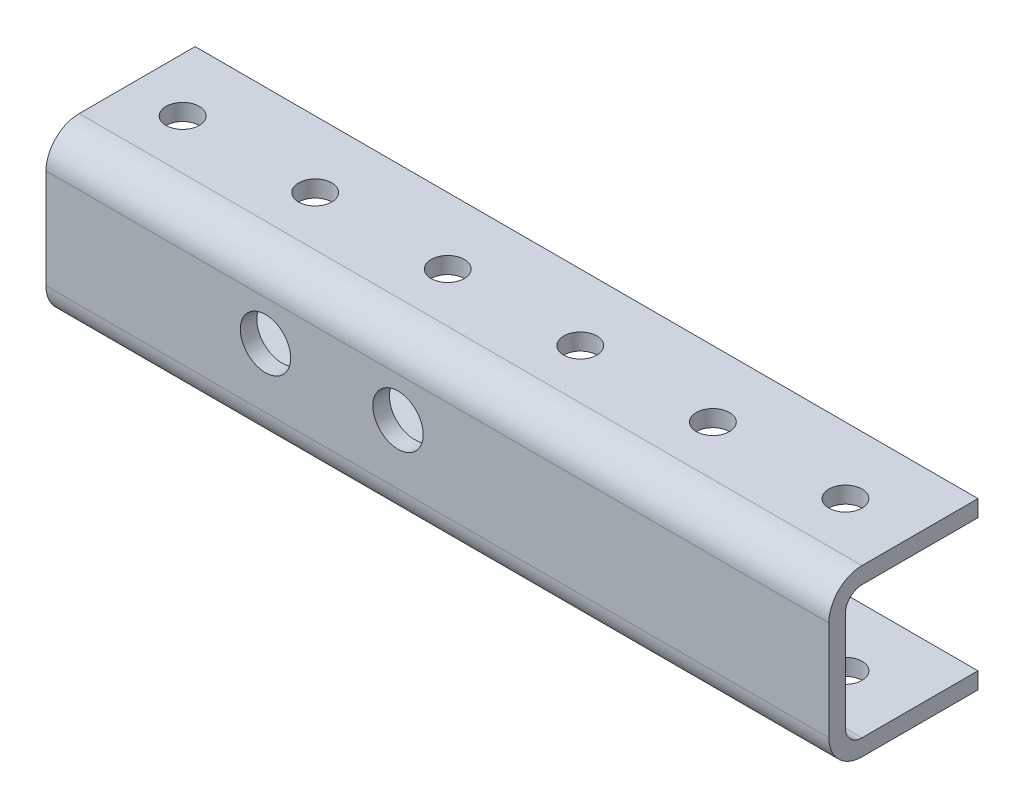
ISO-10303-21;
HEADER;
FILE_DESCRIPTION(('STEP AP214'),'2;1');
FILE_NAME('part.step','',(''),(''),'','','');
FILE_SCHEMA(('AUTOMOTIVE_DESIGN { 1 0 10303 214 1 1 1 1 }'));
ENDSEC;
DATA;
#1=APPLICATION_CONTEXT('core data for automotive mechanical design processes');
#2=APPLICATION_PROTOCOL_DEFINITION('international standard','automotive_design',2000,#1);
#3=PRODUCT_CONTEXT('',#1,'mechanical');
#4=PRODUCT('Part','Part','',(#3));
#5=PRODUCT_RELATED_PRODUCT_CATEGORY('part','',(#4));
#6=PRODUCT_DEFINITION_FORMATION('','',#4);
#7=PRODUCT_DEFINITION_CONTEXT('part definition',#1,'design');
#8=PRODUCT_DEFINITION('design','',#6,#7);
#9=PRODUCT_DEFINITION_SHAPE('','',#8);
#10=(LENGTH_UNIT() NAMED_UNIT(*) SI_UNIT(.MILLI.,.METRE.));
#11=(NAMED_UNIT(*) PLANE_ANGLE_UNIT() SI_UNIT($,.RADIAN.));
#12=(NAMED_UNIT(*) SI_UNIT($,.STERADIAN.) SOLID_ANGLE_UNIT());
#13=UNCERTAINTY_MEASURE_WITH_UNIT(LENGTH_MEASURE(1.E-05),#10,'distance_accuracy_value','');
#14=(GEOMETRIC_REPRESENTATION_CONTEXT(3) GLOBAL_UNCERTAINTY_ASSIGNED_CONTEXT((#13)) GLOBAL_UNIT_ASSIGNED_CONTEXT((#10,
#11,#12)) REPRESENTATION_CONTEXT('',''));
#15=CARTESIAN_POINT('',(0.,0.,0.));
#16=DIRECTION('',(0.,0.,1.));
#17=DIRECTION('',(1.,0.,0.));
#18=AXIS2_PLACEMENT_3D('',#15,#16,#17);
#19=CARTESIAN_POINT('',(872.981011996506,-4.02704283352276,-25.4));
#20=DIRECTION('',(0.,-1.,0.));
#21=DIRECTION('',(0.,0.,-1.));
#22=AXIS2_PLACEMENT_3D('',#19,#20,#21);
#23=PLANE('',#22);
#24=DIRECTION('',(-1.,0.,0.));
#25=VECTOR('',#24,1.);
#26=CARTESIAN_POINT('',(872.981011996506,-4.02704283352276,-25.4));
#27=LINE('',#26,#25);
#28=CARTESIAN_POINT('',(872.980011996506,-4.02704283352276,-25.4));
#29=VERTEX_POINT('',#28);
#30=CARTESIAN_POINT('',(722.980011996506,-4.02704283352276,-25.4));
#31=VERTEX_POINT('',#30);
#32=EDGE_CURVE('E155',#29,#31,#27,.T.);
#33=ORIENTED_EDGE('',*,*,#32,.T.);
#34=DIRECTION('',(0.,0.,1.));
#35=VECTOR('',#34,1.);
#36=CARTESIAN_POINT('',(722.980011996506,-4.02704283352276,-25.4));
#37=LINE('',#36,#35);
#38=CARTESIAN_POINT('',(722.980011996506,-4.02704283352272,-3.175));
#39=VERTEX_POINT('',#38);
#40=EDGE_CURVE('E387',#31,#39,#37,.T.);
#41=ORIENTED_EDGE('',*,*,#40,.T.);
#42=DIRECTION('',(-1.,0.,0.));
#43=VECTOR('',#42,1.);
#44=CARTESIAN_POINT('',(872.980011996506,-4.02704283352272,-3.17499999999999));
#45=LINE('',#44,#43);
#46=CARTESIAN_POINT('',(872.980011996506,-4.02704283352272,-3.17499999999999));
#47=VERTEX_POINT('',#46);
#48=EDGE_CURVE('E251',#39,#47,#45,.F.);
#49=ORIENTED_EDGE('',*,*,#48,.T.);
#50=DIRECTION('',(0.,0.,1.));
#51=VECTOR('',#50,1.);
#52=CARTESIAN_POINT('',(872.980011996506,-4.02704283352276,-25.4));
#53=LINE('',#52,#51);
#54=EDGE_CURVE('E385',#29,#47,#53,.T.);
#55=ORIENTED_EDGE('',*,*,#54,.F.);
#56=EDGE_LOOP('',(#33,#41,#49,#55));
#57=FACE_BOUND('',#56,.T.);
#58=CARTESIAN_POINT('',(733.280011996506,-4.02704283352274,-12.7000000000001));
#59=DIRECTION('',(0.,1.,0.));
#60=DIRECTION('',(0.,0.,1.));
#61=AXIS2_PLACEMENT_3D('',#58,#59,#60);
#62=CIRCLE('',#61,3.17500000000001);
#63=CARTESIAN_POINT('',(733.280011996506,-4.02704283352273,-9.52500000000009));
#64=VERTEX_POINT('',#63);
#65=EDGE_CURVE('E205',#64,#64,#62,.T.);
#66=ORIENTED_EDGE('',*,*,#65,.F.);
#67=EDGE_LOOP('',(#66));
#68=FACE_BOUND('',#67,.T.);
#69=CARTESIAN_POINT('',(758.680011996506,-4.02704283352274,-12.7000000000001));
#70=DIRECTION('',(0.,1.,0.));
#71=DIRECTION('',(0.,0.,1.));
#72=AXIS2_PLACEMENT_3D('',#69,#70,#71);
#73=CIRCLE('',#72,3.17500000000001);
#74=CARTESIAN_POINT('',(758.680011996506,-4.02704283352273,-9.5250000000001));
#75=VERTEX_POINT('',#74);
#76=EDGE_CURVE('E211',#75,#75,#73,.T.);
#77=ORIENTED_EDGE('',*,*,#76,.F.);
#78=EDGE_LOOP('',(#77));
#79=FACE_BOUND('',#78,.T.);
#80=CARTESIAN_POINT('',(784.080011996506,-4.02704283352274,-12.7000000000001));
#81=DIRECTION('',(0.,1.,0.));
#82=DIRECTION('',(0.,0.,1.));
#83=AXIS2_PLACEMENT_3D('',#80,#81,#82);
#84=CIRCLE('',#83,3.17500000000001);
#85=CARTESIAN_POINT('',(784.080011996506,-4.02704283352273,-9.5250000000001));
#86=VERTEX_POINT('',#85);
#87=EDGE_CURVE('E217',#86,#86,#84,.T.);
#88=ORIENTED_EDGE('',*,*,#87,.F.);
#89=EDGE_LOOP('',(#88));
#90=FACE_BOUND('',#89,.T.);
#91=CARTESIAN_POINT('',(809.480011996506,-4.02704283352274,-12.7000000000001));
#92=DIRECTION('',(0.,1.,0.));
#93=DIRECTION('',(0.,0.,1.));
#94=AXIS2_PLACEMENT_3D('',#91,#92,#93);
#95=CIRCLE('',#94,3.17500000000001);
#96=CARTESIAN_POINT('',(809.480011996506,-4.02704283352273,-9.5250000000001));
#97=VERTEX_POINT('',#96);
#98=EDGE_CURVE('E223',#97,#97,#95,.T.);
#99=ORIENTED_EDGE('',*,*,#98,.F.);
#100=EDGE_LOOP('',(#99));
#101=FACE_BOUND('',#100,.T.);
#102=CARTESIAN_POINT('',(834.880011996506,-4.02704283352274,-12.7000000000001));
#103=DIRECTION('',(0.,1.,0.));
#104=DIRECTION('',(0.,0.,1.));
#105=AXIS2_PLACEMENT_3D('',#102,#103,#104);
#106=CIRCLE('',#105,3.17500000000001);
#107=CARTESIAN_POINT('',(834.880011996506,-4.02704283352273,-9.52500000000011));
#108=VERTEX_POINT('',#107);
#109=EDGE_CURVE('E229',#108,#108,#106,.T.);
#110=ORIENTED_EDGE('',*,*,#109,.F.);
#111=EDGE_LOOP('',(#110));
#112=FACE_BOUND('',#111,.T.);
#113=CARTESIAN_POINT('',(860.280011996506,-4.02704283352274,-12.7000000000001));
#114=DIRECTION('',(0.,1.,0.));
#115=DIRECTION('',(0.,0.,1.));
#116=AXIS2_PLACEMENT_3D('',#113,#114,#115);
#117=CIRCLE('',#116,3.17500000000001);
#118=CARTESIAN_POINT('',(860.280011996506,-4.02704283352273,-9.52500000000011));
#119=VERTEX_POINT('',#118);
#120=EDGE_CURVE('E235',#119,#119,#117,.T.);
#121=ORIENTED_EDGE('',*,*,#120,.F.);
#122=EDGE_LOOP('',(#121));
#123=FACE_BOUND('',#122,.T.);
#124=ADVANCED_FACE('F33',(#57,#68,#79,#90,#101,#112,#123),#23,.F.);
#125=CARTESIAN_POINT('',(872.980011996506,-7.20204283352271,-25.4));
#126=DIRECTION('',(0.,0.,1.));
#127=DIRECTION('',(1.,0.,0.));
#128=AXIS2_PLACEMENT_3D('',#125,#126,#127);
#129=PLANE('',#128);
#130=DIRECTION('',(-1.,0.,0.));
#131=VECTOR('',#130,1.);
#132=CARTESIAN_POINT('',(872.981011996506,21.3729571664772,-25.4));
#133=LINE('',#132,#131);
#134=CARTESIAN_POINT('',(872.980011996506,21.3729571664772,-25.4));
#135=VERTEX_POINT('',#134);
#136=CARTESIAN_POINT('',(722.980011996506,21.3729571664772,-25.4));
#137=VERTEX_POINT('',#136);
#138=EDGE_CURVE('E135',#135,#137,#133,.T.);
#139=ORIENTED_EDGE('',*,*,#138,.T.);
#140=DIRECTION('',(0.,-1.,0.));
#141=VECTOR('',#140,1.);
#142=CARTESIAN_POINT('',(722.980011996506,101.547957166477,-25.4));
#143=LINE('',#142,#141);
#144=CARTESIAN_POINT('',(722.980011996506,24.5479571664772,-25.4));
#145=VERTEX_POINT('',#144);
#146=EDGE_CURVE('E123',#145,#137,#143,.T.);
#147=ORIENTED_EDGE('',*,*,#146,.F.);
#148=DIRECTION('',(-1.,0.,0.));
#149=VECTOR('',#148,1.);
#150=CARTESIAN_POINT('',(872.980011996506,24.5479571664772,-25.4));
#151=LINE('',#150,#149);
#152=CARTESIAN_POINT('',(872.980011996506,24.5479571664772,-25.4));
#153=VERTEX_POINT('',#152);
#154=EDGE_CURVE('E133',#153,#145,#151,.T.);
#155=ORIENTED_EDGE('',*,*,#154,.F.);
#156=DIRECTION('',(0.,1.,0.));
#157=VECTOR('',#156,1.);
#158=CARTESIAN_POINT('',(872.980011996506,-7.20204283352271,-25.4));
#159=LINE('',#158,#157);
#160=EDGE_CURVE('E147',#135,#153,#159,.T.);
#161=ORIENTED_EDGE('',*,*,#160,.F.);
#162=EDGE_LOOP('',(#139,#147,#155,#161));
#163=FACE_BOUND('',#162,.T.);
#164=ADVANCED_FACE('F131',(#163),#129,.F.);
#165=CARTESIAN_POINT('',(-16.0199880034941,-7.20204283352271,-25.4));
#166=DIRECTION('',(0.,-1.,0.));
#167=DIRECTION('',(0.,0.,-1.));
#168=AXIS2_PLACEMENT_3D('',#165,#166,#167);
#169=PLANE('',#168);
#170=DIRECTION('',(0.,0.,1.));
#171=VECTOR('',#170,1.);
#172=CARTESIAN_POINT('',(722.980011996506,-7.20204283352271,-25.4));
#173=LINE('',#172,#171);
#174=CARTESIAN_POINT('',(722.980011996506,-7.20204283352271,-25.4));
#175=VERTEX_POINT('',#174);
#176=CARTESIAN_POINT('',(722.980011996506,-7.20204283352271,-3.175));
#177=VERTEX_POINT('',#176);
#178=EDGE_CURVE('E417',#175,#177,#173,.T.);
#179=ORIENTED_EDGE('',*,*,#178,.F.);
#180=DIRECTION('',(1.,0.,0.));
#181=VECTOR('',#180,1.);
#182=CARTESIAN_POINT('',(-16.0199880034941,-7.20204283352271,-25.4));
#183=LINE('',#182,#181);
#184=CARTESIAN_POINT('',(872.980011996506,-7.20204283352271,-25.4));
#185=VERTEX_POINT('',#184);
#186=EDGE_CURVE('E154',#175,#185,#183,.T.);
#187=ORIENTED_EDGE('',*,*,#186,.T.);
#188=DIRECTION('',(0.,0.,1.));
#189=VECTOR('',#188,1.);
#190=CARTESIAN_POINT('',(872.980011996506,-7.20204283352271,-25.4));
#191=LINE('',#190,#189);
#192=CARTESIAN_POINT('',(872.980011996506,-7.20204283352271,-3.175));
#193=VERTEX_POINT('',#192);
#194=EDGE_CURVE('E141',#185,#193,#191,.T.);
#195=ORIENTED_EDGE('',*,*,#194,.T.);
#196=DIRECTION('',(1.,0.,0.));
#197=VECTOR('',#196,1.);
#198=CARTESIAN_POINT('',(-16.0199880034941,-7.20204283352271,-3.175));
#199=LINE('',#198,#197);
#200=EDGE_CURVE('E259',#193,#177,#199,.F.);
#201=ORIENTED_EDGE('',*,*,#200,.T.);
#202=EDGE_LOOP('',(#179,#187,#195,#201));
#203=FACE_BOUND('',#202,.T.);
#204=CARTESIAN_POINT('',(733.280011996506,-7.20204283352271,-12.7000000000001));
#205=DIRECTION('',(0.,-1.,0.));
#206=DIRECTION('',(0.,0.,-1.));
#207=AXIS2_PLACEMENT_3D('',#204,#205,#206);
#208=CIRCLE('',#207,3.17500000000001);
#209=CARTESIAN_POINT('',(733.280011996506,-7.20204283352271,-15.8750000000001));
#210=VERTEX_POINT('',#209);
#211=EDGE_CURVE('E208',#210,#210,#208,.T.);
#212=ORIENTED_EDGE('',*,*,#211,.F.);
#213=EDGE_LOOP('',(#212));
#214=FACE_BOUND('',#213,.T.);
#215=CARTESIAN_POINT('',(758.680011996506,-7.20204283352271,-12.7000000000001));
#216=DIRECTION('',(0.,-1.,0.));
#217=DIRECTION('',(0.,0.,-1.));
#218=AXIS2_PLACEMENT_3D('',#215,#216,#217);
#219=CIRCLE('',#218,3.17500000000001);
#220=CARTESIAN_POINT('',(758.680011996506,-7.20204283352271,-15.8750000000001));
#221=VERTEX_POINT('',#220);
#222=EDGE_CURVE('E214',#221,#221,#219,.T.);
#223=ORIENTED_EDGE('',*,*,#222,.F.);
#224=EDGE_LOOP('',(#223));
#225=FACE_BOUND('',#224,.T.);
#226=CARTESIAN_POINT('',(784.080011996506,-7.20204283352271,-12.7000000000001));
#227=DIRECTION('',(0.,-1.,0.));
#228=DIRECTION('',(0.,0.,-1.));
#229=AXIS2_PLACEMENT_3D('',#226,#227,#228);
#230=CIRCLE('',#229,3.17500000000001);
#231=CARTESIAN_POINT('',(784.080011996506,-7.20204283352271,-15.8750000000001));
#232=VERTEX_POINT('',#231);
#233=EDGE_CURVE('E220',#232,#232,#230,.T.);
#234=ORIENTED_EDGE('',*,*,#233,.F.);
#235=EDGE_LOOP('',(#234));
#236=FACE_BOUND('',#235,.T.);
#237=CARTESIAN_POINT('',(809.480011996506,-7.20204283352271,-12.7000000000001));
#238=DIRECTION('',(0.,-1.,0.));
#239=DIRECTION('',(0.,0.,-1.));
#240=AXIS2_PLACEMENT_3D('',#237,#238,#239);
#241=CIRCLE('',#240,3.17500000000001);
#242=CARTESIAN_POINT('',(809.480011996506,-7.20204283352271,-15.8750000000001));
#243=VERTEX_POINT('',#242);
#244=EDGE_CURVE('E226',#243,#243,#241,.T.);
#245=ORIENTED_EDGE('',*,*,#244,.F.);
#246=EDGE_LOOP('',(#245));
#247=FACE_BOUND('',#246,.T.);
#248=CARTESIAN_POINT('',(834.880011996506,-7.20204283352271,-12.7000000000001));
#249=DIRECTION('',(0.,-1.,0.));
#250=DIRECTION('',(0.,0.,-1.));
#251=AXIS2_PLACEMENT_3D('',#248,#249,#250);
#252=CIRCLE('',#251,3.17500000000001);
#253=CARTESIAN_POINT('',(834.880011996506,-7.20204283352271,-15.8750000000001));
#254=VERTEX_POINT('',#253);
#255=EDGE_CURVE('E232',#254,#254,#252,.T.);
#256=ORIENTED_EDGE('',*,*,#255,.F.);
#257=EDGE_LOOP('',(#256));
#258=FACE_BOUND('',#257,.T.);
#259=CARTESIAN_POINT('',(860.280011996506,-7.20204283352271,-12.7000000000001));
#260=DIRECTION('',(0.,-1.,0.));
#261=DIRECTION('',(0.,0.,-1.));
#262=AXIS2_PLACEMENT_3D('',#259,#260,#261);
#263=CIRCLE('',#262,3.17500000000001);
#264=CARTESIAN_POINT('',(860.280011996506,-7.20204283352271,-15.8750000000001));
#265=VERTEX_POINT('',#264);
#266=EDGE_CURVE('E238',#265,#265,#263,.T.);
#267=ORIENTED_EDGE('',*,*,#266,.F.);
#268=EDGE_LOOP('',(#267));
#269=FACE_BOUND('',#268,.T.);
#270=ADVANCED_FACE('F291',(#203,#214,#225,#236,#247,#258,#269),#169,.T.);
#271=CARTESIAN_POINT('',(872.980011996506,24.5479571664772,-25.4));
#272=DIRECTION('',(0.,1.,0.));
#273=DIRECTION('',(-1.,0.,0.));
#274=AXIS2_PLACEMENT_3D('',#271,#272,#273);
#275=PLANE('',#274);
#276=DIRECTION('',(0.,0.,-1.));
#277=VECTOR('',#276,1.);
#278=CARTESIAN_POINT('',(722.980011996506,24.5479571664772,-25.4));
#279=LINE('',#278,#277);
#280=CARTESIAN_POINT('',(722.980011996506,24.5479571664772,-3.175));
#281=VERTEX_POINT('',#280);
#282=EDGE_CURVE('E120',#281,#145,#279,.T.);
#283=ORIENTED_EDGE('',*,*,#282,.F.);
#284=DIRECTION('',(-1.,0.,0.));
#285=VECTOR('',#284,1.);
#286=CARTESIAN_POINT('',(872.980011996506,24.5479571664772,-3.175));
#287=LINE('',#286,#285);
#288=CARTESIAN_POINT('',(872.980011996506,24.5479571664772,-3.175));
#289=VERTEX_POINT('',#288);
#290=EDGE_CURVE('E55',#281,#289,#287,.F.);
#291=ORIENTED_EDGE('',*,*,#290,.T.);
#292=DIRECTION('',(0.,0.,1.));
#293=VECTOR('',#292,1.);
#294=CARTESIAN_POINT('',(872.980011996506,24.5479571664772,-25.4));
#295=LINE('',#294,#293);
#296=EDGE_CURVE('E140',#153,#289,#295,.T.);
#297=ORIENTED_EDGE('',*,*,#296,.F.);
#298=ORIENTED_EDGE('',*,*,#154,.T.);
#299=EDGE_LOOP('',(#283,#291,#297,#298));
#300=FACE_BOUND('',#299,.T.);
#301=CARTESIAN_POINT('',(733.280011996506,24.5479571664772,-12.7000000000001));
#302=DIRECTION('',(0.,1.,0.));
#303=DIRECTION('',(0.,0.,1.));
#304=AXIS2_PLACEMENT_3D('',#301,#302,#303);
#305=CIRCLE('',#304,3.17500000000001);
#306=CARTESIAN_POINT('',(733.280011996506,24.5479571664772,-9.52500000000004));
#307=VERTEX_POINT('',#306);
#308=EDGE_CURVE('E160',#307,#307,#305,.T.);
#309=ORIENTED_EDGE('',*,*,#308,.F.);
#310=EDGE_LOOP('',(#309));
#311=FACE_BOUND('',#310,.T.);
#312=CARTESIAN_POINT('',(758.680011996506,24.5479571664772,-12.7000000000001));
#313=DIRECTION('',(0.,1.,0.));
#314=DIRECTION('',(0.,0.,1.));
#315=AXIS2_PLACEMENT_3D('',#312,#313,#314);
#316=CIRCLE('',#315,3.17500000000001);
#317=CARTESIAN_POINT('',(758.680011996506,24.5479571664772,-9.52500000000004));
#318=VERTEX_POINT('',#317);
#319=EDGE_CURVE('E166',#318,#318,#316,.T.);
#320=ORIENTED_EDGE('',*,*,#319,.F.);
#321=EDGE_LOOP('',(#320));
#322=FACE_BOUND('',#321,.T.);
#323=CARTESIAN_POINT('',(784.080011996506,24.5479571664772,-12.7000000000001));
#324=DIRECTION('',(0.,1.,0.));
#325=DIRECTION('',(0.,0.,1.));
#326=AXIS2_PLACEMENT_3D('',#323,#324,#325);
#327=CIRCLE('',#326,3.17500000000001);
#328=CARTESIAN_POINT('',(784.080011996506,24.5479571664772,-9.52500000000004));
#329=VERTEX_POINT('',#328);
#330=EDGE_CURVE('E172',#329,#329,#327,.T.);
#331=ORIENTED_EDGE('',*,*,#330,.F.);
#332=EDGE_LOOP('',(#331));
#333=FACE_BOUND('',#332,.T.);
#334=CARTESIAN_POINT('',(809.480011996506,24.5479571664772,-12.7000000000001));
#335=DIRECTION('',(0.,1.,0.));
#336=DIRECTION('',(0.,0.,1.));
#337=AXIS2_PLACEMENT_3D('',#334,#335,#336);
#338=CIRCLE('',#337,3.17500000000001);
#339=CARTESIAN_POINT('',(809.480011996506,24.5479571664772,-9.52500000000004));
#340=VERTEX_POINT('',#339);
#341=EDGE_CURVE('E178',#340,#340,#338,.T.);
#342=ORIENTED_EDGE('',*,*,#341,.F.);
#343=EDGE_LOOP('',(#342));
#344=FACE_BOUND('',#343,.T.);
#345=CARTESIAN_POINT('',(834.880011996506,24.5479571664772,-12.7000000000001));
#346=DIRECTION('',(0.,1.,0.));
#347=DIRECTION('',(0.,0.,1.));
#348=AXIS2_PLACEMENT_3D('',#345,#346,#347);
#349=CIRCLE('',#348,3.17500000000001);
#350=CARTESIAN_POINT('',(834.880011996506,24.5479571664772,-9.52500000000005));
#351=VERTEX_POINT('',#350);
#352=EDGE_CURVE('E184',#351,#351,#349,.T.);
#353=ORIENTED_EDGE('',*,*,#352,.F.);
#354=EDGE_LOOP('',(#353));
#355=FACE_BOUND('',#354,.T.);
#356=CARTESIAN_POINT('',(860.280011996506,24.5479571664772,-12.7000000000001));
#357=DIRECTION('',(0.,1.,0.));
#358=DIRECTION('',(0.,0.,1.));
#359=AXIS2_PLACEMENT_3D('',#356,#357,#358);
#360=CIRCLE('',#359,3.17500000000001);
#361=CARTESIAN_POINT('',(860.280011996506,24.5479571664772,-9.52500000000005));
#362=VERTEX_POINT('',#361);
#363=EDGE_CURVE('E190',#362,#362,#360,.T.);
#364=ORIENTED_EDGE('',*,*,#363,.F.);
#365=EDGE_LOOP('',(#364));
#366=FACE_BOUND('',#365,.T.);
#367=ADVANCED_FACE('F138',(#300,#311,#322,#333,#344,#355,#366),#275,.T.);
#368=CARTESIAN_POINT('',(872.980011996506,-7.20204283352271,-25.4));
#369=DIRECTION('',(1.,0.,0.));
#370=DIRECTION('',(0.,0.,-1.));
#371=AXIS2_PLACEMENT_3D('',#368,#369,#370);
#372=PLANE('',#371);
#373=ORIENTED_EDGE('',*,*,#296,.T.);
#374=CARTESIAN_POINT('',(872.980011996506,18.1979571664772,-3.175));
#375=DIRECTION('',(1.,0.,0.));
#376=DIRECTION('',(0.,0.,-1.));
#377=AXIS2_PLACEMENT_3D('',#374,#375,#376);
#378=CIRCLE('',#377,6.35);
#379=CARTESIAN_POINT('',(872.980011996506,18.1979571664772,3.175));
#380=VERTEX_POINT('',#379);
#381=EDGE_CURVE('E41',#289,#380,#378,.T.);
#382=ORIENTED_EDGE('',*,*,#381,.T.);
#383=DIRECTION('',(0.,1.,0.));
#384=VECTOR('',#383,1.);
#385=CARTESIAN_POINT('',(872.980011996506,-7.20204283352271,3.175));
#386=LINE('',#385,#384);
#387=CARTESIAN_POINT('',(872.980011996506,-0.852042833522709,3.175));
#388=VERTEX_POINT('',#387);
#389=EDGE_CURVE('E151',#388,#380,#386,.T.);
#390=ORIENTED_EDGE('',*,*,#389,.F.);
#391=CARTESIAN_POINT('',(872.980011996506,-0.852042833522709,-3.175));
#392=DIRECTION('',(1.,0.,0.));
#393=DIRECTION('',(0.,0.,-1.));
#394=AXIS2_PLACEMENT_3D('',#391,#392,#393);
#395=CIRCLE('',#394,6.35);
#396=EDGE_CURVE('E257',#388,#193,#395,.T.);
#397=ORIENTED_EDGE('',*,*,#396,.T.);
#398=ORIENTED_EDGE('',*,*,#194,.F.);
#399=EDGE_CURVE('E142',#185,#29,#159,.T.);
#400=ORIENTED_EDGE('',*,*,#399,.T.);
#401=ORIENTED_EDGE('',*,*,#54,.T.);
#402=CARTESIAN_POINT('',(872.980011996506,-0.852042833522716,-3.175));
#403=DIRECTION('',(1.,0.,0.));
#404=DIRECTION('',(0.,0.,-1.));
#405=AXIS2_PLACEMENT_3D('',#402,#403,#404);
#406=CIRCLE('',#405,3.175);
#407=CARTESIAN_POINT('',(872.980011996506,-0.852042833522716,0.));
#408=VERTEX_POINT('',#407);
#409=EDGE_CURVE('E253',#47,#408,#406,.F.);
#410=ORIENTED_EDGE('',*,*,#409,.T.);
#411=DIRECTION('',(0.,1.,0.));
#412=VECTOR('',#411,1.);
#413=CARTESIAN_POINT('',(872.980011996506,-4.02704283352271,0.));
#414=LINE('',#413,#412);
#415=CARTESIAN_POINT('',(872.980011996506,18.1979571664772,0.));
#416=VERTEX_POINT('',#415);
#417=EDGE_CURVE('E392',#408,#416,#414,.T.);
#418=ORIENTED_EDGE('',*,*,#417,.T.);
#419=CARTESIAN_POINT('',(872.980011996506,18.1979571664772,-3.175));
#420=DIRECTION('',(1.,0.,0.));
#421=DIRECTION('',(0.,0.,-1.));
#422=AXIS2_PLACEMENT_3D('',#419,#420,#421);
#423=CIRCLE('',#422,3.175);
#424=CARTESIAN_POINT('',(872.980011996506,21.3729571664772,-3.175));
#425=VERTEX_POINT('',#424);
#426=EDGE_CURVE('E246',#416,#425,#423,.F.);
#427=ORIENTED_EDGE('',*,*,#426,.T.);
#428=DIRECTION('',(0.,0.,-1.));
#429=VECTOR('',#428,1.);
#430=CARTESIAN_POINT('',(872.980011996506,21.3729571664772,0.));
#431=LINE('',#430,#429);
#432=EDGE_CURVE('E395',#425,#135,#431,.T.);
#433=ORIENTED_EDGE('',*,*,#432,.T.);
#434=ORIENTED_EDGE('',*,*,#160,.T.);
#435=EDGE_LOOP('',(#373,#382,#390,#397,#398,#400,#401,#410,#418,#427,#433,#434));
#436=FACE_BOUND('',#435,.T.);
#437=ADVANCED_FACE('F268',(#436),#372,.T.);
#438=ORIENTED_EDGE('',*,*,#186,.F.);
#439=EDGE_CURVE('E136',#31,#175,#143,.T.);
#440=ORIENTED_EDGE('',*,*,#439,.F.);
#441=ORIENTED_EDGE('',*,*,#32,.F.);
#442=ORIENTED_EDGE('',*,*,#399,.F.);
#443=EDGE_LOOP('',(#438,#440,#441,#442));
#444=FACE_BOUND('',#443,.T.);
#445=ADVANCED_FACE('F293',(#444),#129,.F.);
#446=CARTESIAN_POINT('',(872.980011996506,-7.20204283352271,3.175));
#447=DIRECTION('',(0.,0.,1.));
#448=DIRECTION('',(1.,0.,0.));
#449=AXIS2_PLACEMENT_3D('',#446,#447,#448);
#450=PLANE('',#449);
#451=DIRECTION('',(0.,1.,0.));
#452=VECTOR('',#451,1.);
#453=CARTESIAN_POINT('',(722.980011996506,-7.20204283352271,3.175));
#454=LINE('',#453,#452);
#455=CARTESIAN_POINT('',(722.980011996506,-0.85204283352271,3.175));
#456=VERTEX_POINT('',#455);
#457=CARTESIAN_POINT('',(722.980011996506,18.1979571664772,3.175));
#458=VERTEX_POINT('',#457);
#459=EDGE_CURVE('E47',#456,#458,#454,.T.);
#460=ORIENTED_EDGE('',*,*,#459,.F.);
#461=DIRECTION('',(1.,0.,0.));
#462=VECTOR('',#461,1.);
#463=CARTESIAN_POINT('',(872.980011996506,-0.852042833522709,3.175));
#464=LINE('',#463,#462);
#465=EDGE_CURVE('E255',#456,#388,#464,.T.);
#466=ORIENTED_EDGE('',*,*,#465,.T.);
#467=ORIENTED_EDGE('',*,*,#389,.T.);
#468=DIRECTION('',(-1.,0.,0.));
#469=VECTOR('',#468,1.);
#470=CARTESIAN_POINT('',(872.980011996506,18.1979571664772,3.175));
#471=LINE('',#470,#469);
#472=EDGE_CURVE('E262',#380,#458,#471,.T.);
#473=ORIENTED_EDGE('',*,*,#472,.T.);
#474=EDGE_LOOP('',(#460,#466,#467,#473));
#475=FACE_BOUND('',#474,.T.);
#476=CARTESIAN_POINT('',(765.030011996506,10.5779571664772,3.175));
#477=DIRECTION('',(0.,0.,1.));
#478=DIRECTION('',(1.,0.,0.));
#479=AXIS2_PLACEMENT_3D('',#476,#477,#478);
#480=CIRCLE('',#479,4.826);
#481=CARTESIAN_POINT('',(769.856011996506,10.5779571664772,3.175));
#482=VERTEX_POINT('',#481);
#483=EDGE_CURVE('E196',#482,#482,#480,.T.);
#484=ORIENTED_EDGE('',*,*,#483,.F.);
#485=EDGE_LOOP('',(#484));
#486=FACE_BOUND('',#485,.T.);
#487=CARTESIAN_POINT('',(790.430011996506,10.5779571664772,3.175));
#488=DIRECTION('',(0.,0.,1.));
#489=DIRECTION('',(1.,0.,0.));
#490=AXIS2_PLACEMENT_3D('',#487,#488,#489);
#491=CIRCLE('',#490,4.826);
#492=CARTESIAN_POINT('',(795.256011996506,10.5779571664772,3.175));
#493=VERTEX_POINT('',#492);
#494=EDGE_CURVE('E202',#493,#493,#491,.T.);
#495=ORIENTED_EDGE('',*,*,#494,.F.);
#496=EDGE_LOOP('',(#495));
#497=FACE_BOUND('',#496,.T.);
#498=ADVANCED_FACE('F272',(#475,#486,#497),#450,.T.);
#499=CARTESIAN_POINT('',(872.981011996506,21.3729571664772,0.));
#500=DIRECTION('',(0.,1.,0.));
#501=DIRECTION('',(0.,0.,1.));
#502=AXIS2_PLACEMENT_3D('',#499,#500,#501);
#503=PLANE('',#502);
#504=DIRECTION('',(-1.,0.,0.));
#505=VECTOR('',#504,1.);
#506=CARTESIAN_POINT('',(-16.0199880034941,21.3729571664772,-3.175));
#507=LINE('',#506,#505);
#508=CARTESIAN_POINT('',(722.980011996506,21.3729571664772,-3.175));
#509=VERTEX_POINT('',#508);
#510=EDGE_CURVE('E241',#425,#509,#507,.T.);
#511=ORIENTED_EDGE('',*,*,#510,.T.);
#512=DIRECTION('',(0.,0.,-1.));
#513=VECTOR('',#512,1.);
#514=CARTESIAN_POINT('',(722.980011996506,21.3729571664772,0.));
#515=LINE('',#514,#513);
#516=EDGE_CURVE('E393',#509,#137,#515,.T.);
#517=ORIENTED_EDGE('',*,*,#516,.T.);
#518=ORIENTED_EDGE('',*,*,#138,.F.);
#519=ORIENTED_EDGE('',*,*,#432,.F.);
#520=EDGE_LOOP('',(#511,#517,#518,#519));
#521=FACE_BOUND('',#520,.T.);
#522=CARTESIAN_POINT('',(733.280011996506,21.3729571664772,-12.7000000000001));
#523=DIRECTION('',(0.,1.,0.));
#524=DIRECTION('',(0.,0.,1.));
#525=AXIS2_PLACEMENT_3D('',#522,#523,#524);
#526=CIRCLE('',#525,3.17500000000001);
#527=CARTESIAN_POINT('',(733.280011996506,21.3729571664772,-9.52500000000004));
#528=VERTEX_POINT('',#527);
#529=EDGE_CURVE('E156',#528,#528,#526,.T.);
#530=ORIENTED_EDGE('',*,*,#529,.T.);
#531=EDGE_LOOP('',(#530));
#532=FACE_BOUND('',#531,.T.);
#533=CARTESIAN_POINT('',(758.680011996506,21.3729571664772,-12.7000000000001));
#534=DIRECTION('',(0.,1.,0.));
#535=DIRECTION('',(0.,0.,1.));
#536=AXIS2_PLACEMENT_3D('',#533,#534,#535);
#537=CIRCLE('',#536,3.17500000000001);
#538=CARTESIAN_POINT('',(758.680011996506,21.3729571664772,-9.52500000000004));
#539=VERTEX_POINT('',#538);
#540=EDGE_CURVE('E163',#539,#539,#537,.T.);
#541=ORIENTED_EDGE('',*,*,#540,.T.);
#542=EDGE_LOOP('',(#541));
#543=FACE_BOUND('',#542,.T.);
#544=CARTESIAN_POINT('',(784.080011996506,21.3729571664772,-12.7000000000001));
#545=DIRECTION('',(0.,1.,0.));
#546=DIRECTION('',(0.,0.,1.));
#547=AXIS2_PLACEMENT_3D('',#544,#545,#546);
#548=CIRCLE('',#547,3.17500000000001);
#549=CARTESIAN_POINT('',(784.080011996506,21.3729571664772,-9.52500000000004));
#550=VERTEX_POINT('',#549);
#551=EDGE_CURVE('E169',#550,#550,#548,.T.);
#552=ORIENTED_EDGE('',*,*,#551,.T.);
#553=EDGE_LOOP('',(#552));
#554=FACE_BOUND('',#553,.T.);
#555=CARTESIAN_POINT('',(809.480011996506,21.3729571664772,-12.7000000000001));
#556=DIRECTION('',(0.,1.,0.));
#557=DIRECTION('',(0.,0.,1.));
#558=AXIS2_PLACEMENT_3D('',#555,#556,#557);
#559=CIRCLE('',#558,3.17500000000001);
#560=CARTESIAN_POINT('',(809.480011996506,21.3729571664772,-9.52500000000004));
#561=VERTEX_POINT('',#560);
#562=EDGE_CURVE('E175',#561,#561,#559,.T.);
#563=ORIENTED_EDGE('',*,*,#562,.T.);
#564=EDGE_LOOP('',(#563));
#565=FACE_BOUND('',#564,.T.);
#566=CARTESIAN_POINT('',(834.880011996506,21.3729571664772,-12.7000000000001));
#567=DIRECTION('',(0.,1.,0.));
#568=DIRECTION('',(0.,0.,1.));
#569=AXIS2_PLACEMENT_3D('',#566,#567,#568);
#570=CIRCLE('',#569,3.17500000000001);
#571=CARTESIAN_POINT('',(834.880011996506,21.3729571664772,-9.52500000000005));
#572=VERTEX_POINT('',#571);
#573=EDGE_CURVE('E181',#572,#572,#570,.T.);
#574=ORIENTED_EDGE('',*,*,#573,.T.);
#575=EDGE_LOOP('',(#574));
#576=FACE_BOUND('',#575,.T.);
#577=CARTESIAN_POINT('',(860.280011996506,21.3729571664772,-12.7000000000001));
#578=DIRECTION('',(0.,1.,0.));
#579=DIRECTION('',(0.,0.,1.));
#580=AXIS2_PLACEMENT_3D('',#577,#578,#579);
#581=CIRCLE('',#580,3.17500000000001);
#582=CARTESIAN_POINT('',(860.280011996506,21.3729571664772,-9.52500000000005));
#583=VERTEX_POINT('',#582);
#584=EDGE_CURVE('E187',#583,#583,#581,.T.);
#585=ORIENTED_EDGE('',*,*,#584,.T.);
#586=EDGE_LOOP('',(#585));
#587=FACE_BOUND('',#586,.T.);
#588=ADVANCED_FACE('F299',(#521,#532,#543,#554,#565,#576,#587),#503,.F.);
#589=CARTESIAN_POINT('',(872.981011996506,-4.02704283352271,0.));
#590=DIRECTION('',(0.,0.,1.));
#591=DIRECTION('',(1.,0.,0.));
#592=AXIS2_PLACEMENT_3D('',#589,#590,#591);
#593=PLANE('',#592);
#594=DIRECTION('',(-1.,0.,0.));
#595=VECTOR('',#594,1.);
#596=CARTESIAN_POINT('',(-16.0199880034941,-0.852042833522716,0.));
#597=LINE('',#596,#595);
#598=CARTESIAN_POINT('',(722.980011996506,-0.852042833522716,0.));
#599=VERTEX_POINT('',#598);
#600=EDGE_CURVE('E248',#408,#599,#597,.T.);
#601=ORIENTED_EDGE('',*,*,#600,.T.);
#602=DIRECTION('',(0.,1.,0.));
#603=VECTOR('',#602,1.);
#604=CARTESIAN_POINT('',(722.980011996506,-4.02704283352271,0.));
#605=LINE('',#604,#603);
#606=CARTESIAN_POINT('',(722.980011996506,18.1979571664772,0.));
#607=VERTEX_POINT('',#606);
#608=EDGE_CURVE('E412',#599,#607,#605,.T.);
#609=ORIENTED_EDGE('',*,*,#608,.T.);
#610=DIRECTION('',(-1.,0.,0.));
#611=VECTOR('',#610,1.);
#612=CARTESIAN_POINT('',(872.980011996506,18.1979571664772,0.));
#613=LINE('',#612,#611);
#614=EDGE_CURVE('E244',#607,#416,#613,.F.);
#615=ORIENTED_EDGE('',*,*,#614,.T.);
#616=ORIENTED_EDGE('',*,*,#417,.F.);
#617=EDGE_LOOP('',(#601,#609,#615,#616));
#618=FACE_BOUND('',#617,.T.);
#619=CARTESIAN_POINT('',(765.030011996506,10.5779571664772,0.));
#620=DIRECTION('',(0.,0.,1.));
#621=DIRECTION('',(1.,0.,0.));
#622=AXIS2_PLACEMENT_3D('',#619,#620,#621);
#623=CIRCLE('',#622,4.826);
#624=CARTESIAN_POINT('',(769.856011996506,10.5779571664772,0.));
#625=VERTEX_POINT('',#624);
#626=EDGE_CURVE('E193',#625,#625,#623,.T.);
#627=ORIENTED_EDGE('',*,*,#626,.T.);
#628=EDGE_LOOP('',(#627));
#629=FACE_BOUND('',#628,.T.);
#630=CARTESIAN_POINT('',(790.430011996506,10.5779571664772,0.));
#631=DIRECTION('',(0.,0.,1.));
#632=DIRECTION('',(1.,0.,0.));
#633=AXIS2_PLACEMENT_3D('',#630,#631,#632);
#634=CIRCLE('',#633,4.826);
#635=CARTESIAN_POINT('',(795.256011996506,10.5779571664772,0.));
#636=VERTEX_POINT('',#635);
#637=EDGE_CURVE('E199',#636,#636,#634,.T.);
#638=ORIENTED_EDGE('',*,*,#637,.T.);
#639=EDGE_LOOP('',(#638));
#640=FACE_BOUND('',#639,.T.);
#641=ADVANCED_FACE('F298',(#618,#629,#640),#593,.F.);
#642=CARTESIAN_POINT('',(733.280011996506,24.5479571664772,-12.7000000000001));
#643=DIRECTION('',(0.,1.,0.));
#644=DIRECTION('',(0.,0.,1.));
#645=AXIS2_PLACEMENT_3D('',#642,#643,#644);
#646=CYLINDRICAL_SURFACE('',#645,3.17500000000001);
#647=ORIENTED_EDGE('',*,*,#529,.F.);
#648=EDGE_LOOP('',(#647));
#649=FACE_BOUND('',#648,.T.);
#650=ORIENTED_EDGE('',*,*,#308,.T.);
#651=EDGE_LOOP('',(#650));
#652=FACE_BOUND('',#651,.T.);
#653=ADVANCED_FACE('F314',(#649,#652),#646,.F.);
#654=CARTESIAN_POINT('',(758.680011996506,24.5479571664772,-12.7000000000001));
#655=DIRECTION('',(0.,1.,0.));
#656=DIRECTION('',(0.,0.,1.));
#657=AXIS2_PLACEMENT_3D('',#654,#655,#656);
#658=CYLINDRICAL_SURFACE('',#657,3.17500000000001);
#659=ORIENTED_EDGE('',*,*,#540,.F.);
#660=EDGE_LOOP('',(#659));
#661=FACE_BOUND('',#660,.T.);
#662=ORIENTED_EDGE('',*,*,#319,.T.);
#663=EDGE_LOOP('',(#662));
#664=FACE_BOUND('',#663,.T.);
#665=ADVANCED_FACE('F317',(#661,#664),#658,.F.);
#666=CARTESIAN_POINT('',(784.080011996506,24.5479571664772,-12.7000000000001));
#667=DIRECTION('',(0.,1.,0.));
#668=DIRECTION('',(0.,0.,1.));
#669=AXIS2_PLACEMENT_3D('',#666,#667,#668);
#670=CYLINDRICAL_SURFACE('',#669,3.17500000000001);
#671=ORIENTED_EDGE('',*,*,#551,.F.);
#672=EDGE_LOOP('',(#671));
#673=FACE_BOUND('',#672,.T.);
#674=ORIENTED_EDGE('',*,*,#330,.T.);
#675=EDGE_LOOP('',(#674));
#676=FACE_BOUND('',#675,.T.);
#677=ADVANCED_FACE('F321',(#673,#676),#670,.F.);
#678=CARTESIAN_POINT('',(809.480011996506,24.5479571664772,-12.7000000000001));
#679=DIRECTION('',(0.,1.,0.));
#680=DIRECTION('',(0.,0.,1.));
#681=AXIS2_PLACEMENT_3D('',#678,#679,#680);
#682=CYLINDRICAL_SURFACE('',#681,3.17500000000001);
#683=ORIENTED_EDGE('',*,*,#562,.F.);
#684=EDGE_LOOP('',(#683));
#685=FACE_BOUND('',#684,.T.);
#686=ORIENTED_EDGE('',*,*,#341,.T.);
#687=EDGE_LOOP('',(#686));
#688=FACE_BOUND('',#687,.T.);
#689=ADVANCED_FACE('F325',(#685,#688),#682,.F.);
#690=CARTESIAN_POINT('',(834.880011996506,24.5479571664772,-12.7000000000001));
#691=DIRECTION('',(0.,1.,0.));
#692=DIRECTION('',(0.,0.,1.));
#693=AXIS2_PLACEMENT_3D('',#690,#691,#692);
#694=CYLINDRICAL_SURFACE('',#693,3.17500000000001);
#695=ORIENTED_EDGE('',*,*,#573,.F.);
#696=EDGE_LOOP('',(#695));
#697=FACE_BOUND('',#696,.T.);
#698=ORIENTED_EDGE('',*,*,#352,.T.);
#699=EDGE_LOOP('',(#698));
#700=FACE_BOUND('',#699,.T.);
#701=ADVANCED_FACE('F329',(#697,#700),#694,.F.);
#702=CARTESIAN_POINT('',(860.280011996506,24.5479571664772,-12.7000000000001));
#703=DIRECTION('',(0.,1.,0.));
#704=DIRECTION('',(0.,0.,1.));
#705=AXIS2_PLACEMENT_3D('',#702,#703,#704);
#706=CYLINDRICAL_SURFACE('',#705,3.17500000000001);
#707=ORIENTED_EDGE('',*,*,#584,.F.);
#708=EDGE_LOOP('',(#707));
#709=FACE_BOUND('',#708,.T.);
#710=ORIENTED_EDGE('',*,*,#363,.T.);
#711=EDGE_LOOP('',(#710));
#712=FACE_BOUND('',#711,.T.);
#713=ADVANCED_FACE('F333',(#709,#712),#706,.F.);
#714=CARTESIAN_POINT('',(765.030011996506,10.5779571664772,3.175));
#715=DIRECTION('',(0.,0.,1.));
#716=DIRECTION('',(1.,0.,0.));
#717=AXIS2_PLACEMENT_3D('',#714,#715,#716);
#718=CYLINDRICAL_SURFACE('',#717,4.826);
#719=ORIENTED_EDGE('',*,*,#626,.F.);
#720=EDGE_LOOP('',(#719));
#721=FACE_BOUND('',#720,.T.);
#722=ORIENTED_EDGE('',*,*,#483,.T.);
#723=EDGE_LOOP('',(#722));
#724=FACE_BOUND('',#723,.T.);
#725=ADVANCED_FACE('F337',(#721,#724),#718,.F.);
#726=CARTESIAN_POINT('',(790.430011996506,10.5779571664772,3.175));
#727=DIRECTION('',(0.,0.,1.));
#728=DIRECTION('',(1.,0.,0.));
#729=AXIS2_PLACEMENT_3D('',#726,#727,#728);
#730=CYLINDRICAL_SURFACE('',#729,4.826);
#731=ORIENTED_EDGE('',*,*,#637,.F.);
#732=EDGE_LOOP('',(#731));
#733=FACE_BOUND('',#732,.T.);
#734=ORIENTED_EDGE('',*,*,#494,.T.);
#735=EDGE_LOOP('',(#734));
#736=FACE_BOUND('',#735,.T.);
#737=ADVANCED_FACE('F341',(#733,#736),#730,.F.);
#738=CARTESIAN_POINT('',(733.280011996506,-4.02704283352274,-12.7000000000001));
#739=DIRECTION('',(0.,1.,0.));
#740=DIRECTION('',(0.,0.,1.));
#741=AXIS2_PLACEMENT_3D('',#738,#739,#740);
#742=CYLINDRICAL_SURFACE('',#741,3.17500000000001);
#743=ORIENTED_EDGE('',*,*,#65,.T.);
#744=EDGE_LOOP('',(#743));
#745=FACE_BOUND('',#744,.T.);
#746=ORIENTED_EDGE('',*,*,#211,.T.);
#747=EDGE_LOOP('',(#746));
#748=FACE_BOUND('',#747,.T.);
#749=ADVANCED_FACE('F345',(#745,#748),#742,.F.);
#750=CARTESIAN_POINT('',(758.680011996506,-4.02704283352274,-12.7000000000001));
#751=DIRECTION('',(0.,1.,0.));
#752=DIRECTION('',(0.,0.,1.));
#753=AXIS2_PLACEMENT_3D('',#750,#751,#752);
#754=CYLINDRICAL_SURFACE('',#753,3.17500000000001);
#755=ORIENTED_EDGE('',*,*,#76,.T.);
#756=EDGE_LOOP('',(#755));
#757=FACE_BOUND('',#756,.T.);
#758=ORIENTED_EDGE('',*,*,#222,.T.);
#759=EDGE_LOOP('',(#758));
#760=FACE_BOUND('',#759,.T.);
#761=ADVANCED_FACE('F349',(#757,#760),#754,.F.);
#762=CARTESIAN_POINT('',(784.080011996506,-4.02704283352274,-12.7000000000001));
#763=DIRECTION('',(0.,1.,0.));
#764=DIRECTION('',(0.,0.,1.));
#765=AXIS2_PLACEMENT_3D('',#762,#763,#764);
#766=CYLINDRICAL_SURFACE('',#765,3.17500000000001);
#767=ORIENTED_EDGE('',*,*,#87,.T.);
#768=EDGE_LOOP('',(#767));
#769=FACE_BOUND('',#768,.T.);
#770=ORIENTED_EDGE('',*,*,#233,.T.);
#771=EDGE_LOOP('',(#770));
#772=FACE_BOUND('',#771,.T.);
#773=ADVANCED_FACE('F353',(#769,#772),#766,.F.);
#774=CARTESIAN_POINT('',(809.480011996506,-4.02704283352274,-12.7000000000001));
#775=DIRECTION('',(0.,1.,0.));
#776=DIRECTION('',(0.,0.,1.));
#777=AXIS2_PLACEMENT_3D('',#774,#775,#776);
#778=CYLINDRICAL_SURFACE('',#777,3.17500000000001);
#779=ORIENTED_EDGE('',*,*,#98,.T.);
#780=EDGE_LOOP('',(#779));
#781=FACE_BOUND('',#780,.T.);
#782=ORIENTED_EDGE('',*,*,#244,.T.);
#783=EDGE_LOOP('',(#782));
#784=FACE_BOUND('',#783,.T.);
#785=ADVANCED_FACE('F357',(#781,#784),#778,.F.);
#786=CARTESIAN_POINT('',(834.880011996506,-4.02704283352274,-12.7000000000001));
#787=DIRECTION('',(0.,1.,0.));
#788=DIRECTION('',(0.,0.,1.));
#789=AXIS2_PLACEMENT_3D('',#786,#787,#788);
#790=CYLINDRICAL_SURFACE('',#789,3.17500000000001);
#791=ORIENTED_EDGE('',*,*,#109,.T.);
#792=EDGE_LOOP('',(#791));
#793=FACE_BOUND('',#792,.T.);
#794=ORIENTED_EDGE('',*,*,#255,.T.);
#795=EDGE_LOOP('',(#794));
#796=FACE_BOUND('',#795,.T.);
#797=ADVANCED_FACE('F361',(#793,#796),#790,.F.);
#798=CARTESIAN_POINT('',(860.280011996506,-4.02704283352274,-12.7000000000001));
#799=DIRECTION('',(0.,1.,0.));
#800=DIRECTION('',(0.,0.,1.));
#801=AXIS2_PLACEMENT_3D('',#798,#799,#800);
#802=CYLINDRICAL_SURFACE('',#801,3.17500000000001);
#803=ORIENTED_EDGE('',*,*,#120,.T.);
#804=EDGE_LOOP('',(#803));
#805=FACE_BOUND('',#804,.T.);
#806=ORIENTED_EDGE('',*,*,#266,.T.);
#807=EDGE_LOOP('',(#806));
#808=FACE_BOUND('',#807,.T.);
#809=ADVANCED_FACE('F365',(#805,#808),#802,.F.);
#810=CARTESIAN_POINT('',(872.981011996506,18.1979571664772,-3.175));
#811=DIRECTION('',(1.,0.,0.));
#812=DIRECTION('',(0.,0.,-1.));
#813=AXIS2_PLACEMENT_3D('',#810,#811,#812);
#814=CYLINDRICAL_SURFACE('',#813,3.175);
#815=ORIENTED_EDGE('',*,*,#614,.F.);
#816=CARTESIAN_POINT('',(722.980011996506,18.1979571664772,-3.175));
#817=DIRECTION('',(1.,0.,0.));
#818=DIRECTION('',(0.,1.,0.));
#819=AXIS2_PLACEMENT_3D('',#816,#817,#818);
#820=CIRCLE('',#819,3.175);
#821=EDGE_CURVE('E397',#607,#509,#820,.F.);
#822=ORIENTED_EDGE('',*,*,#821,.T.);
#823=ORIENTED_EDGE('',*,*,#510,.F.);
#824=ORIENTED_EDGE('',*,*,#426,.F.);
#825=EDGE_LOOP('',(#815,#822,#823,#824));
#826=FACE_BOUND('',#825,.T.);
#827=ADVANCED_FACE('F369',(#826),#814,.F.);
#828=CARTESIAN_POINT('',(872.981011996506,-0.852042833522716,-3.175));
#829=DIRECTION('',(1.,0.,0.));
#830=DIRECTION('',(0.,0.,-1.));
#831=AXIS2_PLACEMENT_3D('',#828,#829,#830);
#832=CYLINDRICAL_SURFACE('',#831,3.175);
#833=ORIENTED_EDGE('',*,*,#48,.F.);
#834=CARTESIAN_POINT('',(722.980011996506,-0.852042833522716,-3.175));
#835=DIRECTION('',(1.,0.,0.));
#836=DIRECTION('',(0.,1.,0.));
#837=AXIS2_PLACEMENT_3D('',#834,#835,#836);
#838=CIRCLE('',#837,3.175);
#839=EDGE_CURVE('E382',#39,#599,#838,.F.);
#840=ORIENTED_EDGE('',*,*,#839,.T.);
#841=ORIENTED_EDGE('',*,*,#600,.F.);
#842=ORIENTED_EDGE('',*,*,#409,.F.);
#843=EDGE_LOOP('',(#833,#840,#841,#842));
#844=FACE_BOUND('',#843,.T.);
#845=ADVANCED_FACE('F283',(#844),#832,.F.);
#846=CARTESIAN_POINT('',(872.980011996506,-0.852042833522709,-3.175));
#847=DIRECTION('',(1.,0.,0.));
#848=DIRECTION('',(0.,0.,-1.));
#849=AXIS2_PLACEMENT_3D('',#846,#847,#848);
#850=CYLINDRICAL_SURFACE('',#849,6.35);
#851=CARTESIAN_POINT('',(722.980011996506,-0.852042833522709,-3.175));
#852=DIRECTION('',(1.,0.,0.));
#853=DIRECTION('',(0.,1.,0.));
#854=AXIS2_PLACEMENT_3D('',#851,#852,#853);
#855=CIRCLE('',#854,6.35);
#856=EDGE_CURVE('E126',#177,#456,#855,.F.);
#857=ORIENTED_EDGE('',*,*,#856,.F.);
#858=ORIENTED_EDGE('',*,*,#200,.F.);
#859=ORIENTED_EDGE('',*,*,#396,.F.);
#860=ORIENTED_EDGE('',*,*,#465,.F.);
#861=EDGE_LOOP('',(#857,#858,#859,#860));
#862=FACE_BOUND('',#861,.T.);
#863=ADVANCED_FACE('F277',(#862),#850,.T.);
#864=CARTESIAN_POINT('',(872.980011996506,18.1979571664772,-3.175));
#865=DIRECTION('',(-1.,0.,0.));
#866=DIRECTION('',(0.,-1.,0.));
#867=AXIS2_PLACEMENT_3D('',#864,#865,#866);
#868=CYLINDRICAL_SURFACE('',#867,6.35);
#869=CARTESIAN_POINT('',(722.980011996506,18.1979571664772,-3.175));
#870=DIRECTION('',(1.,0.,0.));
#871=DIRECTION('',(0.,1.,0.));
#872=AXIS2_PLACEMENT_3D('',#869,#870,#871);
#873=CIRCLE('',#872,6.35);
#874=EDGE_CURVE('E11',#458,#281,#873,.F.);
#875=ORIENTED_EDGE('',*,*,#874,.F.);
#876=ORIENTED_EDGE('',*,*,#472,.F.);
#877=ORIENTED_EDGE('',*,*,#381,.F.);
#878=ORIENTED_EDGE('',*,*,#290,.F.);
#879=EDGE_LOOP('',(#875,#876,#877,#878));
#880=FACE_BOUND('',#879,.T.);
#881=ADVANCED_FACE('F35',(#880),#868,.T.);
#882=CARTESIAN_POINT('',(722.980011996506,101.547957166477,0.));
#883=DIRECTION('',(1.,0.,0.));
#884=DIRECTION('',(0.,1.,0.));
#885=AXIS2_PLACEMENT_3D('',#882,#883,#884);
#886=PLANE('',#885);
#887=ORIENTED_EDGE('',*,*,#821,.F.);
#888=ORIENTED_EDGE('',*,*,#608,.F.);
#889=ORIENTED_EDGE('',*,*,#839,.F.);
#890=ORIENTED_EDGE('',*,*,#40,.F.);
#891=ORIENTED_EDGE('',*,*,#439,.T.);
#892=ORIENTED_EDGE('',*,*,#178,.T.);
#893=ORIENTED_EDGE('',*,*,#856,.T.);
#894=ORIENTED_EDGE('',*,*,#459,.T.);
#895=ORIENTED_EDGE('',*,*,#874,.T.);
#896=ORIENTED_EDGE('',*,*,#282,.T.);
#897=ORIENTED_EDGE('',*,*,#146,.T.);
#898=ORIENTED_EDGE('',*,*,#516,.F.);
#899=EDGE_LOOP('',(#887,#888,#889,#890,#891,#892,#893,#894,#895,#896,#897,#898));
#900=FACE_BOUND('',#899,.T.);
#901=ADVANCED_FACE('F122',(#900),#886,.F.);
#902=CLOSED_SHELL('',(#124,#164,#270,#367,#437,#445,#498,#588,#641,#653,#665,#677,#689,#701,
#713,#725,#737,#749,#761,#773,#785,#797,#809,#827,#845,#863,#881,#901));
#903=MANIFOLD_SOLID_BREP('B2',#902);
#904=ADVANCED_BREP_SHAPE_REPRESENTATION('',(#18,#903),#14);
#905=SHAPE_DEFINITION_REPRESENTATION(#9,#904);
ENDSEC;
END-ISO-10303-21;
